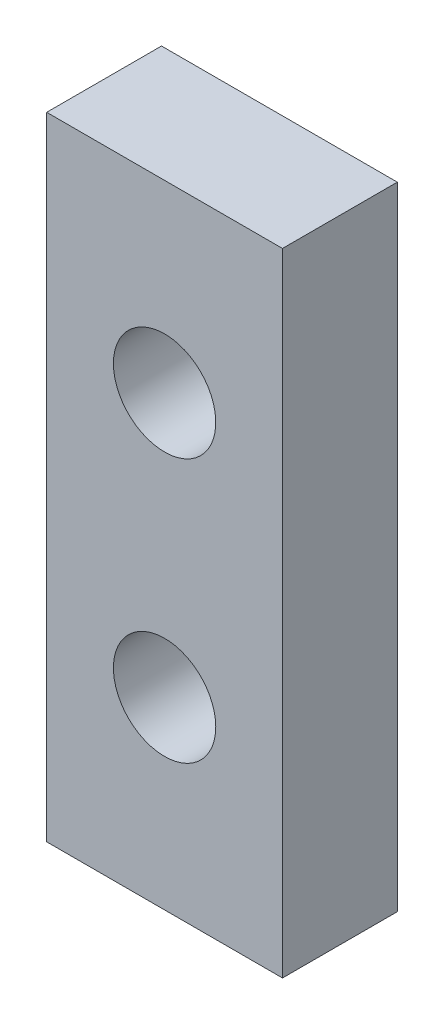
ISO-10303-21;
HEADER;
FILE_DESCRIPTION(('STEP AP214'),'2;1');
FILE_NAME('part.step','',(''),(''),'','','');
FILE_SCHEMA(('AUTOMOTIVE_DESIGN { 1 0 10303 214 1 1 1 1 }'));
ENDSEC;
DATA;
#1=APPLICATION_CONTEXT('core data for automotive mechanical design processes');
#2=APPLICATION_PROTOCOL_DEFINITION('international standard','automotive_design',2000,#1);
#3=PRODUCT_CONTEXT('',#1,'mechanical');
#4=PRODUCT('Part','Part','',(#3));
#5=PRODUCT_RELATED_PRODUCT_CATEGORY('part','',(#4));
#6=PRODUCT_DEFINITION_FORMATION('','',#4);
#7=PRODUCT_DEFINITION_CONTEXT('part definition',#1,'design');
#8=PRODUCT_DEFINITION('design','',#6,#7);
#9=PRODUCT_DEFINITION_SHAPE('','',#8);
#10=(LENGTH_UNIT() NAMED_UNIT(*) SI_UNIT(.MILLI.,.METRE.));
#11=(NAMED_UNIT(*) PLANE_ANGLE_UNIT() SI_UNIT($,.RADIAN.));
#12=(NAMED_UNIT(*) SI_UNIT($,.STERADIAN.) SOLID_ANGLE_UNIT());
#13=UNCERTAINTY_MEASURE_WITH_UNIT(LENGTH_MEASURE(1.E-05),#10,'distance_accuracy_value','');
#14=(GEOMETRIC_REPRESENTATION_CONTEXT(3) GLOBAL_UNCERTAINTY_ASSIGNED_CONTEXT((#13)) GLOBAL_UNIT_ASSIGNED_CONTEXT((#10,
#11,#12)) REPRESENTATION_CONTEXT('',''));
#15=CARTESIAN_POINT('',(0.,0.,0.));
#16=DIRECTION('',(0.,0.,1.));
#17=DIRECTION('',(1.,0.,0.));
#18=AXIS2_PLACEMENT_3D('',#15,#16,#17);
#19=CARTESIAN_POINT('',(3.26,8.735,3.175));
#20=DIRECTION('',(-1.,0.,0.));
#21=DIRECTION('',(0.,-1.,0.));
#22=AXIS2_PLACEMENT_3D('',#19,#20,#21);
#23=PLANE('',#22);
#24=DIRECTION('',(0.,1.,0.));
#25=VECTOR('',#24,1.);
#26=CARTESIAN_POINT('',(3.26,8.735,0.));
#27=LINE('',#26,#25);
#28=CARTESIAN_POINT('',(3.26,-8.735,0.));
#29=VERTEX_POINT('',#28);
#30=CARTESIAN_POINT('',(3.26,8.735,0.));
#31=VERTEX_POINT('',#30);
#32=EDGE_CURVE('E99',#29,#31,#27,.T.);
#33=ORIENTED_EDGE('',*,*,#32,.T.);
#34=DIRECTION('',(0.,0.,-1.));
#35=VECTOR('',#34,1.);
#36=CARTESIAN_POINT('',(3.26,8.735,3.175));
#37=LINE('',#36,#35);
#38=CARTESIAN_POINT('',(3.26,8.735,3.175));
#39=VERTEX_POINT('',#38);
#40=EDGE_CURVE('E11',#39,#31,#37,.T.);
#41=ORIENTED_EDGE('',*,*,#40,.F.);
#42=DIRECTION('',(0.,1.,0.));
#43=VECTOR('',#42,1.);
#44=CARTESIAN_POINT('',(3.26,8.735,3.175));
#45=LINE('',#44,#43);
#46=CARTESIAN_POINT('',(3.26,-8.735,3.175));
#47=VERTEX_POINT('',#46);
#48=EDGE_CURVE('E87',#47,#39,#45,.T.);
#49=ORIENTED_EDGE('',*,*,#48,.F.);
#50=DIRECTION('',(0.,0.,-1.));
#51=VECTOR('',#50,1.);
#52=CARTESIAN_POINT('',(3.26,-8.735,3.175));
#53=LINE('',#52,#51);
#54=EDGE_CURVE('E95',#47,#29,#53,.T.);
#55=ORIENTED_EDGE('',*,*,#54,.T.);
#56=EDGE_LOOP('',(#33,#41,#49,#55));
#57=FACE_BOUND('',#56,.T.);
#58=ADVANCED_FACE('F36',(#57),#23,.F.);
#59=CARTESIAN_POINT('',(-3.26,8.735,3.175));
#60=DIRECTION('',(0.,-1.,0.));
#61=DIRECTION('',(0.,0.,-1.));
#62=AXIS2_PLACEMENT_3D('',#59,#60,#61);
#63=PLANE('',#62);
#64=DIRECTION('',(-1.,0.,0.));
#65=VECTOR('',#64,1.);
#66=CARTESIAN_POINT('',(-3.26,8.735,0.));
#67=LINE('',#66,#65);
#68=CARTESIAN_POINT('',(-3.26,8.735,0.));
#69=VERTEX_POINT('',#68);
#70=EDGE_CURVE('E91',#31,#69,#67,.T.);
#71=ORIENTED_EDGE('',*,*,#70,.T.);
#72=DIRECTION('',(0.,0.,-1.));
#73=VECTOR('',#72,1.);
#74=CARTESIAN_POINT('',(-3.26,8.735,3.175));
#75=LINE('',#74,#73);
#76=CARTESIAN_POINT('',(-3.26,8.735,3.175));
#77=VERTEX_POINT('',#76);
#78=EDGE_CURVE('E44',#77,#69,#75,.T.);
#79=ORIENTED_EDGE('',*,*,#78,.F.);
#80=DIRECTION('',(-1.,0.,0.));
#81=VECTOR('',#80,1.);
#82=CARTESIAN_POINT('',(-3.26,8.735,3.175));
#83=LINE('',#82,#81);
#84=EDGE_CURVE('E82',#39,#77,#83,.T.);
#85=ORIENTED_EDGE('',*,*,#84,.F.);
#86=ORIENTED_EDGE('',*,*,#40,.T.);
#87=EDGE_LOOP('',(#71,#79,#85,#86));
#88=FACE_BOUND('',#87,.T.);
#89=ADVANCED_FACE('F90',(#88),#63,.F.);
#90=CARTESIAN_POINT('',(-3.26,8.735,3.175));
#91=DIRECTION('',(1.,0.,0.));
#92=DIRECTION('',(0.,1.,0.));
#93=AXIS2_PLACEMENT_3D('',#90,#91,#92);
#94=PLANE('',#93);
#95=DIRECTION('',(0.,-1.,0.));
#96=VECTOR('',#95,1.);
#97=CARTESIAN_POINT('',(-3.26,8.735,0.));
#98=LINE('',#97,#96);
#99=CARTESIAN_POINT('',(-3.26,-8.735,0.));
#100=VERTEX_POINT('',#99);
#101=EDGE_CURVE('E69',#69,#100,#98,.T.);
#102=ORIENTED_EDGE('',*,*,#101,.T.);
#103=DIRECTION('',(0.,0.,-1.));
#104=VECTOR('',#103,1.);
#105=CARTESIAN_POINT('',(-3.26,-8.735,3.175));
#106=LINE('',#105,#104);
#107=CARTESIAN_POINT('',(-3.26,-8.735,3.175));
#108=VERTEX_POINT('',#107);
#109=EDGE_CURVE('E92',#108,#100,#106,.T.);
#110=ORIENTED_EDGE('',*,*,#109,.F.);
#111=DIRECTION('',(0.,-1.,0.));
#112=VECTOR('',#111,1.);
#113=CARTESIAN_POINT('',(-3.26,8.735,3.175));
#114=LINE('',#113,#112);
#115=EDGE_CURVE('E85',#77,#108,#114,.T.);
#116=ORIENTED_EDGE('',*,*,#115,.F.);
#117=ORIENTED_EDGE('',*,*,#78,.T.);
#118=EDGE_LOOP('',(#102,#110,#116,#117));
#119=FACE_BOUND('',#118,.T.);
#120=ADVANCED_FACE('F93',(#119),#94,.F.);
#121=CARTESIAN_POINT('',(-3.26,-8.735,3.175));
#122=DIRECTION('',(0.,1.,0.));
#123=DIRECTION('',(0.,0.,1.));
#124=AXIS2_PLACEMENT_3D('',#121,#122,#123);
#125=PLANE('',#124);
#126=DIRECTION('',(1.,0.,0.));
#127=VECTOR('',#126,1.);
#128=CARTESIAN_POINT('',(-3.26,-8.735,0.));
#129=LINE('',#128,#127);
#130=EDGE_CURVE('E75',#100,#29,#129,.T.);
#131=ORIENTED_EDGE('',*,*,#130,.T.);
#132=ORIENTED_EDGE('',*,*,#54,.F.);
#133=DIRECTION('',(1.,0.,0.));
#134=VECTOR('',#133,1.);
#135=CARTESIAN_POINT('',(-3.26,-8.735,3.175));
#136=LINE('',#135,#134);
#137=EDGE_CURVE('E52',#108,#47,#136,.T.);
#138=ORIENTED_EDGE('',*,*,#137,.F.);
#139=ORIENTED_EDGE('',*,*,#109,.T.);
#140=EDGE_LOOP('',(#131,#132,#138,#139));
#141=FACE_BOUND('',#140,.T.);
#142=ADVANCED_FACE('F107',(#141),#125,.F.);
#143=CARTESIAN_POINT('',(0.,0.,3.175));
#144=DIRECTION('',(0.,0.,1.));
#145=DIRECTION('',(1.,0.,0.));
#146=AXIS2_PLACEMENT_3D('',#143,#144,#145);
#147=PLANE('',#146);
#148=CARTESIAN_POINT('',(0.,-3.645,3.175));
#149=DIRECTION('',(0.,0.,1.));
#150=DIRECTION('',(1.,0.,0.));
#151=AXIS2_PLACEMENT_3D('',#148,#149,#150);
#152=CIRCLE('',#151,1.415);
#153=CARTESIAN_POINT('',(1.415,-3.645,3.175));
#154=VERTEX_POINT('',#153);
#155=EDGE_CURVE('E119',#154,#154,#152,.T.);
#156=ORIENTED_EDGE('',*,*,#155,.F.);
#157=EDGE_LOOP('',(#156));
#158=FACE_BOUND('',#157,.T.);
#159=CARTESIAN_POINT('',(0.,3.645,3.175));
#160=DIRECTION('',(0.,0.,1.));
#161=DIRECTION('',(-1.,0.,0.));
#162=AXIS2_PLACEMENT_3D('',#159,#160,#161);
#163=CIRCLE('',#162,1.415);
#164=CARTESIAN_POINT('',(-1.415,3.645,3.175));
#165=VERTEX_POINT('',#164);
#166=EDGE_CURVE('E113',#165,#165,#163,.T.);
#167=ORIENTED_EDGE('',*,*,#166,.F.);
#168=EDGE_LOOP('',(#167));
#169=FACE_BOUND('',#168,.T.);
#170=ORIENTED_EDGE('',*,*,#48,.T.);
#171=ORIENTED_EDGE('',*,*,#84,.T.);
#172=ORIENTED_EDGE('',*,*,#115,.T.);
#173=ORIENTED_EDGE('',*,*,#137,.T.);
#174=EDGE_LOOP('',(#170,#171,#172,#173));
#175=FACE_BOUND('',#174,.T.);
#176=ADVANCED_FACE('F83',(#158,#169,#175),#147,.T.);
#177=CARTESIAN_POINT('',(0.,0.,0.));
#178=DIRECTION('',(0.,0.,1.));
#179=DIRECTION('',(1.,0.,0.));
#180=AXIS2_PLACEMENT_3D('',#177,#178,#179);
#181=PLANE('',#180);
#182=CARTESIAN_POINT('',(0.,-3.645,0.));
#183=DIRECTION('',(0.,0.,1.));
#184=DIRECTION('',(1.,0.,0.));
#185=AXIS2_PLACEMENT_3D('',#182,#183,#184);
#186=CIRCLE('',#185,1.415);
#187=CARTESIAN_POINT('',(1.415,-3.645,0.));
#188=VERTEX_POINT('',#187);
#189=EDGE_CURVE('E102',#188,#188,#186,.T.);
#190=ORIENTED_EDGE('',*,*,#189,.T.);
#191=EDGE_LOOP('',(#190));
#192=FACE_BOUND('',#191,.T.);
#193=CARTESIAN_POINT('',(0.,3.645,0.));
#194=DIRECTION('',(0.,0.,1.));
#195=DIRECTION('',(-1.,0.,0.));
#196=AXIS2_PLACEMENT_3D('',#193,#194,#195);
#197=CIRCLE('',#196,1.415);
#198=CARTESIAN_POINT('',(-1.415,3.645,0.));
#199=VERTEX_POINT('',#198);
#200=EDGE_CURVE('E116',#199,#199,#197,.T.);
#201=ORIENTED_EDGE('',*,*,#200,.T.);
#202=EDGE_LOOP('',(#201));
#203=FACE_BOUND('',#202,.T.);
#204=ORIENTED_EDGE('',*,*,#32,.F.);
#205=ORIENTED_EDGE('',*,*,#130,.F.);
#206=ORIENTED_EDGE('',*,*,#101,.F.);
#207=ORIENTED_EDGE('',*,*,#70,.F.);
#208=EDGE_LOOP('',(#204,#205,#206,#207));
#209=FACE_BOUND('',#208,.T.);
#210=ADVANCED_FACE('F110',(#192,#203,#209),#181,.F.);
#211=CARTESIAN_POINT('',(0.,3.645,0.));
#212=DIRECTION('',(0.,0.,1.));
#213=DIRECTION('',(1.,0.,0.));
#214=AXIS2_PLACEMENT_3D('',#211,#212,#213);
#215=CYLINDRICAL_SURFACE('',#214,1.415);
#216=ORIENTED_EDGE('',*,*,#200,.F.);
#217=EDGE_LOOP('',(#216));
#218=FACE_BOUND('',#217,.T.);
#219=ORIENTED_EDGE('',*,*,#166,.T.);
#220=EDGE_LOOP('',(#219));
#221=FACE_BOUND('',#220,.T.);
#222=ADVANCED_FACE('F130',(#218,#221),#215,.F.);
#223=CARTESIAN_POINT('',(0.,-3.645,0.));
#224=DIRECTION('',(0.,0.,1.));
#225=DIRECTION('',(1.,0.,0.));
#226=AXIS2_PLACEMENT_3D('',#223,#224,#225);
#227=CYLINDRICAL_SURFACE('',#226,1.415);
#228=ORIENTED_EDGE('',*,*,#189,.F.);
#229=EDGE_LOOP('',(#228));
#230=FACE_BOUND('',#229,.T.);
#231=ORIENTED_EDGE('',*,*,#155,.T.);
#232=EDGE_LOOP('',(#231));
#233=FACE_BOUND('',#232,.T.);
#234=ADVANCED_FACE('F127',(#230,#233),#227,.F.);
#235=CLOSED_SHELL('',(#58,#89,#120,#142,#176,#210,#222,#234));
#236=MANIFOLD_SOLID_BREP('B2',#235);
#237=ADVANCED_BREP_SHAPE_REPRESENTATION('',(#18,#236),#14);
#238=SHAPE_DEFINITION_REPRESENTATION(#9,#237);
ENDSEC;
END-ISO-10303-21;
